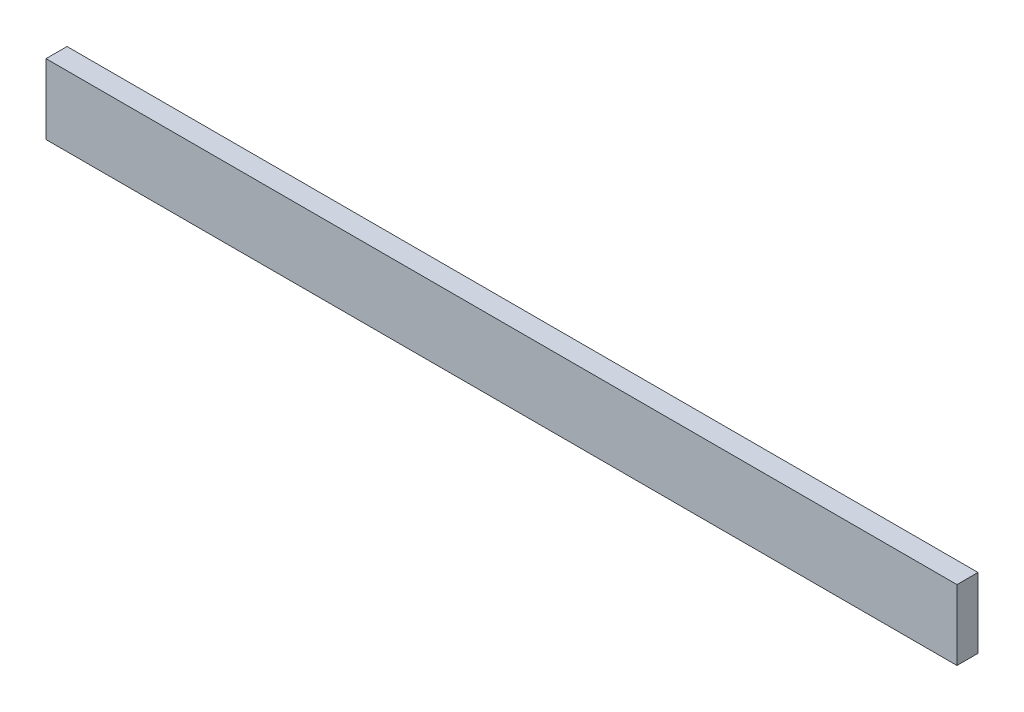
ISO-10303-21;
HEADER;
FILE_DESCRIPTION(('STEP AP214'),'2;1');
FILE_NAME('part.step','',(''),(''),'','','');
FILE_SCHEMA(('AUTOMOTIVE_DESIGN { 1 0 10303 214 1 1 1 1 }'));
ENDSEC;
DATA;
#1=APPLICATION_CONTEXT('core data for automotive mechanical design processes');
#2=APPLICATION_PROTOCOL_DEFINITION('international standard','automotive_design',2000,#1);
#3=PRODUCT_CONTEXT('',#1,'mechanical');
#4=PRODUCT('Part','Part','',(#3));
#5=PRODUCT_RELATED_PRODUCT_CATEGORY('part','',(#4));
#6=PRODUCT_DEFINITION_FORMATION('','',#4);
#7=PRODUCT_DEFINITION_CONTEXT('part definition',#1,'design');
#8=PRODUCT_DEFINITION('design','',#6,#7);
#9=PRODUCT_DEFINITION_SHAPE('','',#8);
#10=(LENGTH_UNIT() NAMED_UNIT(*) SI_UNIT(.MILLI.,.METRE.));
#11=(NAMED_UNIT(*) PLANE_ANGLE_UNIT() SI_UNIT($,.RADIAN.));
#12=(NAMED_UNIT(*) SI_UNIT($,.STERADIAN.) SOLID_ANGLE_UNIT());
#13=UNCERTAINTY_MEASURE_WITH_UNIT(LENGTH_MEASURE(1.E-05),#10,'distance_accuracy_value','');
#14=(GEOMETRIC_REPRESENTATION_CONTEXT(3) GLOBAL_UNCERTAINTY_ASSIGNED_CONTEXT((#13)) GLOBAL_UNIT_ASSIGNED_CONTEXT((#10,
#11,#12)) REPRESENTATION_CONTEXT('',''));
#15=CARTESIAN_POINT('',(0.,0.,0.));
#16=DIRECTION('',(0.,0.,1.));
#17=DIRECTION('',(1.,0.,0.));
#18=AXIS2_PLACEMENT_3D('',#15,#16,#17);
#19=CARTESIAN_POINT('',(-72.1078711805088,0.,3.));
#20=DIRECTION('',(1.,0.,0.));
#21=DIRECTION('',(0.,0.,-1.));
#22=AXIS2_PLACEMENT_3D('',#19,#20,#21);
#23=PLANE('',#22);
#24=DIRECTION('',(0.,-1.,0.));
#25=VECTOR('',#24,1.);
#26=CARTESIAN_POINT('',(-72.1078711805088,0.,0.));
#27=LINE('',#26,#25);
#28=CARTESIAN_POINT('',(-72.1078711805088,0.,0.));
#29=VERTEX_POINT('',#28);
#30=CARTESIAN_POINT('',(-72.1078711805088,-10.,0.));
#31=VERTEX_POINT('',#30);
#32=EDGE_CURVE('E96',#29,#31,#27,.T.);
#33=ORIENTED_EDGE('',*,*,#32,.T.);
#34=DIRECTION('',(0.,0.,-1.));
#35=VECTOR('',#34,1.);
#36=CARTESIAN_POINT('',(-72.1078711805088,-10.,3.));
#37=LINE('',#36,#35);
#38=CARTESIAN_POINT('',(-72.1078711805088,-10.,3.));
#39=VERTEX_POINT('',#38);
#40=EDGE_CURVE('E11',#39,#31,#37,.T.);
#41=ORIENTED_EDGE('',*,*,#40,.F.);
#42=DIRECTION('',(0.,-1.,0.));
#43=VECTOR('',#42,1.);
#44=CARTESIAN_POINT('',(-72.1078711805088,0.,3.));
#45=LINE('',#44,#43);
#46=CARTESIAN_POINT('',(-72.1078711805088,0.,3.));
#47=VERTEX_POINT('',#46);
#48=EDGE_CURVE('E84',#47,#39,#45,.T.);
#49=ORIENTED_EDGE('',*,*,#48,.F.);
#50=DIRECTION('',(0.,0.,-1.));
#51=VECTOR('',#50,1.);
#52=CARTESIAN_POINT('',(-72.1078711805088,0.,3.));
#53=LINE('',#52,#51);
#54=EDGE_CURVE('E92',#47,#29,#53,.T.);
#55=ORIENTED_EDGE('',*,*,#54,.T.);
#56=EDGE_LOOP('',(#33,#41,#49,#55));
#57=FACE_BOUND('',#56,.T.);
#58=ADVANCED_FACE('F33',(#57),#23,.F.);
#59=CARTESIAN_POINT('',(-72.1078711805088,-10.,3.));
#60=DIRECTION('',(0.,1.,0.));
#61=DIRECTION('',(0.,0.,1.));
#62=AXIS2_PLACEMENT_3D('',#59,#60,#61);
#63=PLANE('',#62);
#64=DIRECTION('',(1.,0.,0.));
#65=VECTOR('',#64,1.);
#66=CARTESIAN_POINT('',(-72.1078711805088,-10.,0.));
#67=LINE('',#66,#65);
#68=CARTESIAN_POINT('',(57.8921288194912,-10.,0.));
#69=VERTEX_POINT('',#68);
#70=EDGE_CURVE('E88',#31,#69,#67,.T.);
#71=ORIENTED_EDGE('',*,*,#70,.T.);
#72=DIRECTION('',(0.,0.,-1.));
#73=VECTOR('',#72,1.);
#74=CARTESIAN_POINT('',(57.8921288194912,-10.,3.));
#75=LINE('',#74,#73);
#76=CARTESIAN_POINT('',(57.8921288194912,-10.,3.));
#77=VERTEX_POINT('',#76);
#78=EDGE_CURVE('E41',#77,#69,#75,.T.);
#79=ORIENTED_EDGE('',*,*,#78,.F.);
#80=DIRECTION('',(1.,0.,0.));
#81=VECTOR('',#80,1.);
#82=CARTESIAN_POINT('',(-72.1078711805088,-10.,3.));
#83=LINE('',#82,#81);
#84=EDGE_CURVE('E79',#39,#77,#83,.T.);
#85=ORIENTED_EDGE('',*,*,#84,.F.);
#86=ORIENTED_EDGE('',*,*,#40,.T.);
#87=EDGE_LOOP('',(#71,#79,#85,#86));
#88=FACE_BOUND('',#87,.T.);
#89=ADVANCED_FACE('F87',(#88),#63,.F.);
#90=CARTESIAN_POINT('',(57.8921288194912,0.,3.));
#91=DIRECTION('',(-1.,0.,0.));
#92=DIRECTION('',(0.,0.,1.));
#93=AXIS2_PLACEMENT_3D('',#90,#91,#92);
#94=PLANE('',#93);
#95=DIRECTION('',(0.,1.,0.));
#96=VECTOR('',#95,1.);
#97=CARTESIAN_POINT('',(57.8921288194912,0.,0.));
#98=LINE('',#97,#96);
#99=CARTESIAN_POINT('',(57.8921288194912,0.,0.));
#100=VERTEX_POINT('',#99);
#101=EDGE_CURVE('E66',#69,#100,#98,.T.);
#102=ORIENTED_EDGE('',*,*,#101,.T.);
#103=DIRECTION('',(0.,0.,-1.));
#104=VECTOR('',#103,1.);
#105=CARTESIAN_POINT('',(57.8921288194912,0.,3.));
#106=LINE('',#105,#104);
#107=CARTESIAN_POINT('',(57.8921288194912,0.,3.));
#108=VERTEX_POINT('',#107);
#109=EDGE_CURVE('E89',#108,#100,#106,.T.);
#110=ORIENTED_EDGE('',*,*,#109,.F.);
#111=DIRECTION('',(0.,1.,0.));
#112=VECTOR('',#111,1.);
#113=CARTESIAN_POINT('',(57.8921288194912,0.,3.));
#114=LINE('',#113,#112);
#115=EDGE_CURVE('E82',#77,#108,#114,.T.);
#116=ORIENTED_EDGE('',*,*,#115,.F.);
#117=ORIENTED_EDGE('',*,*,#78,.T.);
#118=EDGE_LOOP('',(#102,#110,#116,#117));
#119=FACE_BOUND('',#118,.T.);
#120=ADVANCED_FACE('F90',(#119),#94,.F.);
#121=CARTESIAN_POINT('',(-72.1078711805088,0.,3.));
#122=DIRECTION('',(0.,-1.,0.));
#123=DIRECTION('',(0.,0.,-1.));
#124=AXIS2_PLACEMENT_3D('',#121,#122,#123);
#125=PLANE('',#124);
#126=DIRECTION('',(-1.,0.,0.));
#127=VECTOR('',#126,1.);
#128=CARTESIAN_POINT('',(-72.1078711805088,0.,0.));
#129=LINE('',#128,#127);
#130=EDGE_CURVE('E72',#100,#29,#129,.T.);
#131=ORIENTED_EDGE('',*,*,#130,.T.);
#132=ORIENTED_EDGE('',*,*,#54,.F.);
#133=DIRECTION('',(-1.,0.,0.));
#134=VECTOR('',#133,1.);
#135=CARTESIAN_POINT('',(-72.1078711805088,0.,3.));
#136=LINE('',#135,#134);
#137=EDGE_CURVE('E49',#108,#47,#136,.T.);
#138=ORIENTED_EDGE('',*,*,#137,.F.);
#139=ORIENTED_EDGE('',*,*,#109,.T.);
#140=EDGE_LOOP('',(#131,#132,#138,#139));
#141=FACE_BOUND('',#140,.T.);
#142=ADVANCED_FACE('F103',(#141),#125,.F.);
#143=CARTESIAN_POINT('',(0.,0.,3.));
#144=DIRECTION('',(0.,0.,1.));
#145=DIRECTION('',(1.,0.,0.));
#146=AXIS2_PLACEMENT_3D('',#143,#144,#145);
#147=PLANE('',#146);
#148=ORIENTED_EDGE('',*,*,#48,.T.);
#149=ORIENTED_EDGE('',*,*,#84,.T.);
#150=ORIENTED_EDGE('',*,*,#115,.T.);
#151=ORIENTED_EDGE('',*,*,#137,.T.);
#152=EDGE_LOOP('',(#148,#149,#150,#151));
#153=FACE_BOUND('',#152,.T.);
#154=ADVANCED_FACE('F80',(#153),#147,.T.);
#155=CARTESIAN_POINT('',(0.,0.,0.));
#156=DIRECTION('',(0.,0.,1.));
#157=DIRECTION('',(1.,0.,0.));
#158=AXIS2_PLACEMENT_3D('',#155,#156,#157);
#159=PLANE('',#158);
#160=ORIENTED_EDGE('',*,*,#32,.F.);
#161=ORIENTED_EDGE('',*,*,#130,.F.);
#162=ORIENTED_EDGE('',*,*,#101,.F.);
#163=ORIENTED_EDGE('',*,*,#70,.F.);
#164=EDGE_LOOP('',(#160,#161,#162,#163));
#165=FACE_BOUND('',#164,.T.);
#166=ADVANCED_FACE('F106',(#165),#159,.F.);
#167=CLOSED_SHELL('',(#58,#89,#120,#142,#154,#166));
#168=MANIFOLD_SOLID_BREP('B2',#167);
#169=ADVANCED_BREP_SHAPE_REPRESENTATION('',(#18,#168),#14);
#170=SHAPE_DEFINITION_REPRESENTATION(#9,#169);
ENDSEC;
END-ISO-10303-21;
